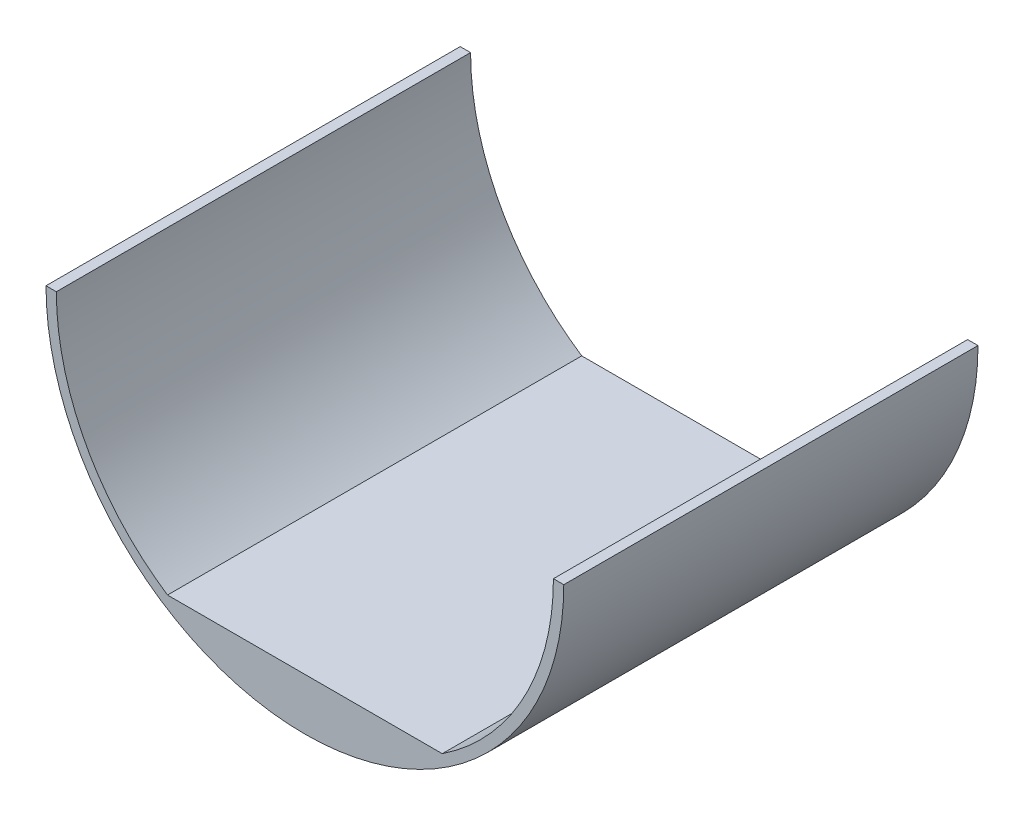
ISO-10303-21;
HEADER;
FILE_DESCRIPTION(('STEP AP214'),'2;1');
FILE_NAME('part.step','',(''),(''),'','','');
FILE_SCHEMA(('AUTOMOTIVE_DESIGN { 1 0 10303 214 1 1 1 1 }'));
ENDSEC;
DATA;
#1=APPLICATION_CONTEXT('core data for automotive mechanical design processes');
#2=APPLICATION_PROTOCOL_DEFINITION('international standard','automotive_design',2000,#1);
#3=PRODUCT_CONTEXT('',#1,'mechanical');
#4=PRODUCT('Part','Part','',(#3));
#5=PRODUCT_RELATED_PRODUCT_CATEGORY('part','',(#4));
#6=PRODUCT_DEFINITION_FORMATION('','',#4);
#7=PRODUCT_DEFINITION_CONTEXT('part definition',#1,'design');
#8=PRODUCT_DEFINITION('design','',#6,#7);
#9=PRODUCT_DEFINITION_SHAPE('','',#8);
#10=(LENGTH_UNIT() NAMED_UNIT(*) SI_UNIT(.MILLI.,.METRE.));
#11=(NAMED_UNIT(*) PLANE_ANGLE_UNIT() SI_UNIT($,.RADIAN.));
#12=(NAMED_UNIT(*) SI_UNIT($,.STERADIAN.) SOLID_ANGLE_UNIT());
#13=UNCERTAINTY_MEASURE_WITH_UNIT(LENGTH_MEASURE(1.E-05),#10,'distance_accuracy_value','');
#14=(GEOMETRIC_REPRESENTATION_CONTEXT(3) GLOBAL_UNCERTAINTY_ASSIGNED_CONTEXT((#13)) GLOBAL_UNIT_ASSIGNED_CONTEXT((#10,
#11,#12)) REPRESENTATION_CONTEXT('',''));
#15=CARTESIAN_POINT('',(0.,0.,0.));
#16=DIRECTION('',(0.,0.,1.));
#17=DIRECTION('',(1.,0.,0.));
#18=AXIS2_PLACEMENT_3D('',#15,#16,#17);
#19=CARTESIAN_POINT('',(0.,0.,101.6));
#20=DIRECTION('',(0.,0.,-1.));
#21=DIRECTION('',(-1.,0.,0.));
#22=AXIS2_PLACEMENT_3D('',#19,#20,#21);
#23=CYLINDRICAL_SURFACE('',#22,60.96);
#24=CARTESIAN_POINT('',(0.,0.,0.));
#25=DIRECTION('',(0.,0.,1.));
#26=DIRECTION('',(1.,0.,0.));
#27=AXIS2_PLACEMENT_3D('',#24,#25,#26);
#28=CIRCLE('',#27,60.96);
#29=CARTESIAN_POINT('',(-60.96,0.,0.));
#30=VERTEX_POINT('',#29);
#31=CARTESIAN_POINT('',(-33.6969078700108,-50.8,0.));
#32=VERTEX_POINT('',#31);
#33=EDGE_CURVE('E141',#30,#32,#28,.T.);
#34=ORIENTED_EDGE('',*,*,#33,.F.);
#35=DIRECTION('',(0.,0.,-1.));
#36=VECTOR('',#35,1.);
#37=CARTESIAN_POINT('',(-60.96,0.,101.6));
#38=LINE('',#37,#36);
#39=CARTESIAN_POINT('',(-60.96,0.,101.6));
#40=VERTEX_POINT('',#39);
#41=EDGE_CURVE('E11',#40,#30,#38,.T.);
#42=ORIENTED_EDGE('',*,*,#41,.F.);
#43=CARTESIAN_POINT('',(0.,0.,101.6));
#44=DIRECTION('',(0.,0.,1.));
#45=DIRECTION('',(1.,0.,0.));
#46=AXIS2_PLACEMENT_3D('',#43,#44,#45);
#47=CIRCLE('',#46,60.96);
#48=CARTESIAN_POINT('',(-33.6969078700108,-50.8,101.6));
#49=VERTEX_POINT('',#48);
#50=EDGE_CURVE('E126',#40,#49,#47,.T.);
#51=ORIENTED_EDGE('',*,*,#50,.T.);
#52=DIRECTION('',(0.,0.,-1.));
#53=VECTOR('',#52,1.);
#54=CARTESIAN_POINT('',(-33.6969078700108,-50.8,101.6));
#55=LINE('',#54,#53);
#56=EDGE_CURVE('E61',#49,#32,#55,.T.);
#57=ORIENTED_EDGE('',*,*,#56,.T.);
#58=EDGE_LOOP('',(#34,#42,#51,#57));
#59=FACE_BOUND('',#58,.T.);
#60=ADVANCED_FACE('F43',(#59),#23,.F.);
#61=CARTESIAN_POINT('',(0.,0.,101.6));
#62=DIRECTION('',(0.,-1.,0.));
#63=DIRECTION('',(0.,0.,-1.));
#64=AXIS2_PLACEMENT_3D('',#61,#62,#63);
#65=PLANE('',#64);
#66=DIRECTION('',(-1.,0.,0.));
#67=VECTOR('',#66,1.);
#68=CARTESIAN_POINT('',(0.,0.,0.));
#69=LINE('',#68,#67);
#70=CARTESIAN_POINT('',(-63.5,0.,0.));
#71=VERTEX_POINT('',#70);
#72=EDGE_CURVE('E161',#30,#71,#69,.T.);
#73=ORIENTED_EDGE('',*,*,#72,.T.);
#74=DIRECTION('',(0.,0.,-1.));
#75=VECTOR('',#74,1.);
#76=CARTESIAN_POINT('',(-63.5,0.,101.6));
#77=LINE('',#76,#75);
#78=CARTESIAN_POINT('',(-63.5,0.,101.6));
#79=VERTEX_POINT('',#78);
#80=EDGE_CURVE('E53',#79,#71,#77,.T.);
#81=ORIENTED_EDGE('',*,*,#80,.F.);
#82=DIRECTION('',(-1.,0.,0.));
#83=VECTOR('',#82,1.);
#84=CARTESIAN_POINT('',(0.,0.,101.6));
#85=LINE('',#84,#83);
#86=EDGE_CURVE('E131',#40,#79,#85,.T.);
#87=ORIENTED_EDGE('',*,*,#86,.F.);
#88=ORIENTED_EDGE('',*,*,#41,.T.);
#89=EDGE_LOOP('',(#73,#81,#87,#88));
#90=FACE_BOUND('',#89,.T.);
#91=ADVANCED_FACE('F45',(#90),#65,.F.);
#92=CARTESIAN_POINT('',(0.,0.,101.6));
#93=DIRECTION('',(0.,0.,-1.));
#94=DIRECTION('',(-1.,0.,0.));
#95=AXIS2_PLACEMENT_3D('',#92,#93,#94);
#96=CYLINDRICAL_SURFACE('',#95,63.5);
#97=CARTESIAN_POINT('',(0.,0.,0.));
#98=DIRECTION('',(0.,0.,1.));
#99=DIRECTION('',(1.,0.,0.));
#100=AXIS2_PLACEMENT_3D('',#97,#98,#99);
#101=CIRCLE('',#100,63.5);
#102=CARTESIAN_POINT('',(63.5,0.,0.));
#103=VERTEX_POINT('',#102);
#104=EDGE_CURVE('E157',#71,#103,#101,.T.);
#105=ORIENTED_EDGE('',*,*,#104,.T.);
#106=DIRECTION('',(0.,0.,-1.));
#107=VECTOR('',#106,1.);
#108=CARTESIAN_POINT('',(63.5,0.,101.6));
#109=LINE('',#108,#107);
#110=CARTESIAN_POINT('',(63.5,0.,101.6));
#111=VERTEX_POINT('',#110);
#112=EDGE_CURVE('E109',#111,#103,#109,.T.);
#113=ORIENTED_EDGE('',*,*,#112,.F.);
#114=CARTESIAN_POINT('',(0.,0.,101.6));
#115=DIRECTION('',(0.,0.,1.));
#116=DIRECTION('',(1.,0.,0.));
#117=AXIS2_PLACEMENT_3D('',#114,#115,#116);
#118=CIRCLE('',#117,63.5);
#119=EDGE_CURVE('E118',#79,#111,#118,.T.);
#120=ORIENTED_EDGE('',*,*,#119,.F.);
#121=ORIENTED_EDGE('',*,*,#80,.T.);
#122=EDGE_LOOP('',(#105,#113,#120,#121));
#123=FACE_BOUND('',#122,.T.);
#124=ADVANCED_FACE('F156',(#123),#96,.T.);
#125=CARTESIAN_POINT('',(0.,0.,101.6));
#126=DIRECTION('',(0.,1.,0.));
#127=DIRECTION('',(0.,0.,1.));
#128=AXIS2_PLACEMENT_3D('',#125,#126,#127);
#129=PLANE('',#128);
#130=DIRECTION('',(1.,0.,0.));
#131=VECTOR('',#130,1.);
#132=CARTESIAN_POINT('',(0.,0.,0.));
#133=LINE('',#132,#131);
#134=CARTESIAN_POINT('',(60.96,0.,0.));
#135=VERTEX_POINT('',#134);
#136=EDGE_CURVE('E104',#135,#103,#133,.T.);
#137=ORIENTED_EDGE('',*,*,#136,.F.);
#138=DIRECTION('',(0.,0.,-1.));
#139=VECTOR('',#138,1.);
#140=CARTESIAN_POINT('',(60.96,0.,101.6));
#141=LINE('',#140,#139);
#142=CARTESIAN_POINT('',(60.96,0.,101.6));
#143=VERTEX_POINT('',#142);
#144=EDGE_CURVE('E99',#143,#135,#141,.T.);
#145=ORIENTED_EDGE('',*,*,#144,.F.);
#146=DIRECTION('',(1.,0.,0.));
#147=VECTOR('',#146,1.);
#148=CARTESIAN_POINT('',(0.,0.,101.6));
#149=LINE('',#148,#147);
#150=EDGE_CURVE('E102',#143,#111,#149,.T.);
#151=ORIENTED_EDGE('',*,*,#150,.T.);
#152=ORIENTED_EDGE('',*,*,#112,.T.);
#153=EDGE_LOOP('',(#137,#145,#151,#152));
#154=FACE_BOUND('',#153,.T.);
#155=ADVANCED_FACE('F101',(#154),#129,.T.);
#156=CARTESIAN_POINT('',(33.6969078700108,-50.8,0.));
#157=VERTEX_POINT('',#156);
#158=EDGE_CURVE('E136',#157,#135,#28,.T.);
#159=ORIENTED_EDGE('',*,*,#158,.F.);
#160=DIRECTION('',(0.,0.,-1.));
#161=VECTOR('',#160,1.);
#162=CARTESIAN_POINT('',(33.6969078700108,-50.8,101.6));
#163=LINE('',#162,#161);
#164=CARTESIAN_POINT('',(33.6969078700108,-50.8,101.6));
#165=VERTEX_POINT('',#164);
#166=EDGE_CURVE('E80',#165,#157,#163,.T.);
#167=ORIENTED_EDGE('',*,*,#166,.F.);
#168=EDGE_CURVE('E116',#165,#143,#47,.T.);
#169=ORIENTED_EDGE('',*,*,#168,.T.);
#170=ORIENTED_EDGE('',*,*,#144,.T.);
#171=EDGE_LOOP('',(#159,#167,#169,#170));
#172=FACE_BOUND('',#171,.T.);
#173=ADVANCED_FACE('F122',(#172),#23,.F.);
#174=CARTESIAN_POINT('',(0.,-50.8,101.6));
#175=DIRECTION('',(0.,1.,0.));
#176=DIRECTION('',(0.,0.,1.));
#177=AXIS2_PLACEMENT_3D('',#174,#175,#176);
#178=PLANE('',#177);
#179=DIRECTION('',(1.,0.,0.));
#180=VECTOR('',#179,1.);
#181=CARTESIAN_POINT('',(0.,-50.8,0.));
#182=LINE('',#181,#180);
#183=EDGE_CURVE('E132',#32,#157,#182,.T.);
#184=ORIENTED_EDGE('',*,*,#183,.F.);
#185=ORIENTED_EDGE('',*,*,#56,.F.);
#186=DIRECTION('',(1.,0.,0.));
#187=VECTOR('',#186,1.);
#188=CARTESIAN_POINT('',(0.,-50.8,101.6));
#189=LINE('',#188,#187);
#190=EDGE_CURVE('E124',#49,#165,#189,.T.);
#191=ORIENTED_EDGE('',*,*,#190,.T.);
#192=ORIENTED_EDGE('',*,*,#166,.T.);
#193=EDGE_LOOP('',(#184,#185,#191,#192));
#194=FACE_BOUND('',#193,.T.);
#195=ADVANCED_FACE('F169',(#194),#178,.T.);
#196=CARTESIAN_POINT('',(0.,0.,101.6));
#197=DIRECTION('',(0.,0.,1.));
#198=DIRECTION('',(1.,0.,0.));
#199=AXIS2_PLACEMENT_3D('',#196,#197,#198);
#200=PLANE('',#199);
#201=ORIENTED_EDGE('',*,*,#50,.F.);
#202=ORIENTED_EDGE('',*,*,#86,.T.);
#203=ORIENTED_EDGE('',*,*,#119,.T.);
#204=ORIENTED_EDGE('',*,*,#150,.F.);
#205=ORIENTED_EDGE('',*,*,#168,.F.);
#206=ORIENTED_EDGE('',*,*,#190,.F.);
#207=EDGE_LOOP('',(#201,#202,#203,#204,#205,#206));
#208=FACE_BOUND('',#207,.T.);
#209=ADVANCED_FACE('F114',(#208),#200,.T.);
#210=CARTESIAN_POINT('',(0.,0.,0.));
#211=DIRECTION('',(0.,0.,1.));
#212=DIRECTION('',(1.,0.,0.));
#213=AXIS2_PLACEMENT_3D('',#210,#211,#212);
#214=PLANE('',#213);
#215=ORIENTED_EDGE('',*,*,#33,.T.);
#216=ORIENTED_EDGE('',*,*,#183,.T.);
#217=ORIENTED_EDGE('',*,*,#158,.T.);
#218=ORIENTED_EDGE('',*,*,#136,.T.);
#219=ORIENTED_EDGE('',*,*,#104,.F.);
#220=ORIENTED_EDGE('',*,*,#72,.F.);
#221=EDGE_LOOP('',(#215,#216,#217,#218,#219,#220));
#222=FACE_BOUND('',#221,.T.);
#223=ADVANCED_FACE('F160',(#222),#214,.F.);
#224=CLOSED_SHELL('',(#60,#91,#124,#155,#173,#195,#209,#223));
#225=MANIFOLD_SOLID_BREP('B2',#224);
#226=ADVANCED_BREP_SHAPE_REPRESENTATION('',(#18,#225),#14);
#227=SHAPE_DEFINITION_REPRESENTATION(#9,#226);
ENDSEC;
END-ISO-10303-21;
